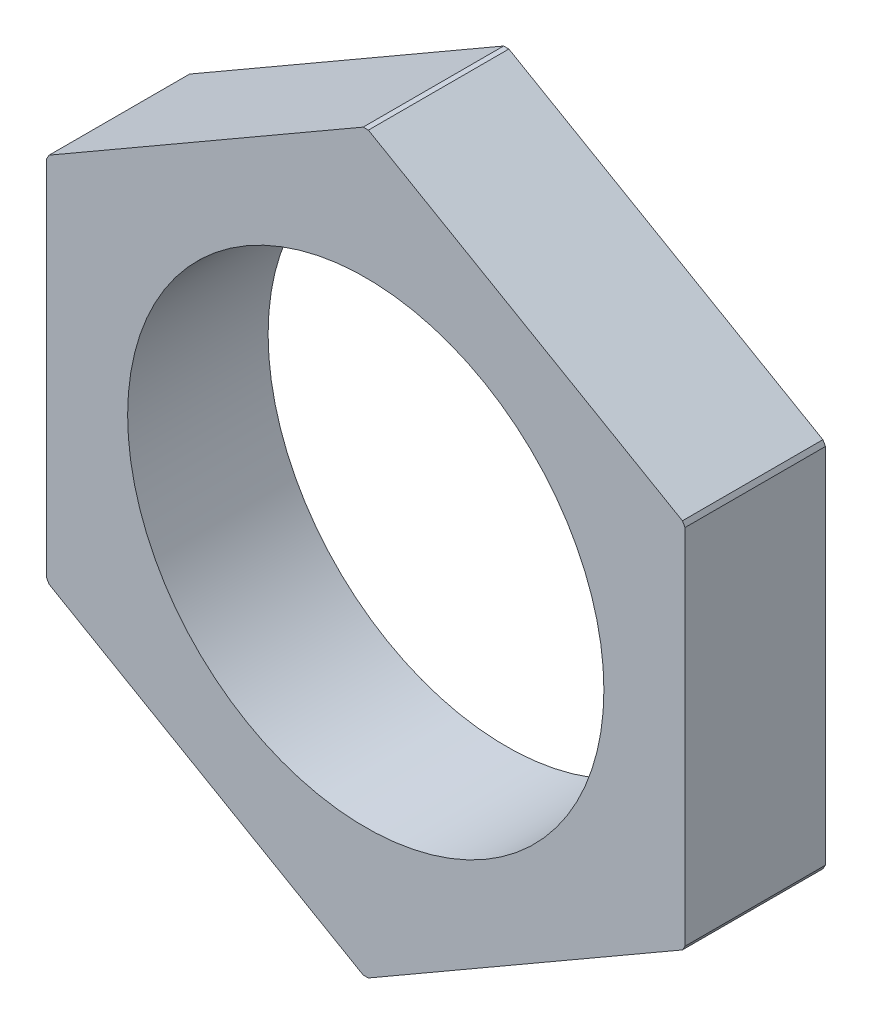
ISO-10303-21;
HEADER;
FILE_DESCRIPTION(('STEP AP214'),'2;1');
FILE_NAME('part.step','',(''),(''),'','','');
FILE_SCHEMA(('AUTOMOTIVE_DESIGN { 1 0 10303 214 1 1 1 1 }'));
ENDSEC;
DATA;
#1=APPLICATION_CONTEXT('core data for automotive mechanical design processes');
#2=APPLICATION_PROTOCOL_DEFINITION('international standard','automotive_design',2000,#1);
#3=PRODUCT_CONTEXT('',#1,'mechanical');
#4=PRODUCT('Part','Part','',(#3));
#5=PRODUCT_RELATED_PRODUCT_CATEGORY('part','',(#4));
#6=PRODUCT_DEFINITION_FORMATION('','',#4);
#7=PRODUCT_DEFINITION_CONTEXT('part definition',#1,'design');
#8=PRODUCT_DEFINITION('design','',#6,#7);
#9=PRODUCT_DEFINITION_SHAPE('','',#8);
#10=(LENGTH_UNIT() NAMED_UNIT(*) SI_UNIT(.MILLI.,.METRE.));
#11=(NAMED_UNIT(*) PLANE_ANGLE_UNIT() SI_UNIT($,.RADIAN.));
#12=(NAMED_UNIT(*) SI_UNIT($,.STERADIAN.) SOLID_ANGLE_UNIT());
#13=UNCERTAINTY_MEASURE_WITH_UNIT(LENGTH_MEASURE(1.E-05),#10,'distance_accuracy_value','');
#14=(GEOMETRIC_REPRESENTATION_CONTEXT(3) GLOBAL_UNCERTAINTY_ASSIGNED_CONTEXT((#13)) GLOBAL_UNIT_ASSIGNED_CONTEXT((#10,
#11,#12)) REPRESENTATION_CONTEXT('',''));
#15=CARTESIAN_POINT('',(0.,0.,0.));
#16=DIRECTION('',(0.,0.,1.));
#17=DIRECTION('',(1.,0.,0.));
#18=AXIS2_PLACEMENT_3D('',#15,#16,#17);
#19=CARTESIAN_POINT('',(-2.8,0.,5.));
#20=DIRECTION('',(0.,0.,-1.));
#21=DIRECTION('',(0.,1.,0.));
#22=AXIS2_PLACEMENT_3D('',#19,#20,#21);
#23=PLANE('',#22);
#24=CARTESIAN_POINT('',(-2.8,0.,5.));
#25=DIRECTION('',(0.,0.,1.));
#26=DIRECTION('',(1.,0.,0.));
#27=AXIS2_PLACEMENT_3D('',#24,#25,#26);
#28=CIRCLE('',#27,5.75);
#29=CARTESIAN_POINT('',(-7.75903944661326,2.91039993247213,5.));
#30=VERTEX_POINT('',#29);
#31=CARTESIAN_POINT('',(-7.8,2.83945417290015,5.));
#32=VERTEX_POINT('',#31);
#33=EDGE_CURVE('E195',#30,#32,#28,.T.);
#34=ORIENTED_EDGE('',*,*,#33,.F.);
#35=DIRECTION('',(-0.866025403784438,-0.5,0.));
#36=VECTOR('',#35,1.);
#37=CARTESIAN_POINT('',(-2.84096055338675,5.74985410537227,5.));
#38=LINE('',#37,#36);
#39=CARTESIAN_POINT('',(-2.84096055338675,5.74985410537227,5.));
#40=VERTEX_POINT('',#39);
#41=EDGE_CURVE('E40',#40,#30,#38,.T.);
#42=ORIENTED_EDGE('',*,*,#41,.F.);
#43=CARTESIAN_POINT('',(-2.8,0.,5.));
#44=DIRECTION('',(0.,0.,1.));
#45=DIRECTION('',(1.,0.,0.));
#46=AXIS2_PLACEMENT_3D('',#43,#44,#45);
#47=CIRCLE('',#46,5.75);
#48=CARTESIAN_POINT('',(-2.75903944661325,5.74985410537227,5.));
#49=VERTEX_POINT('',#48);
#50=EDGE_CURVE('E173',#49,#40,#47,.T.);
#51=ORIENTED_EDGE('',*,*,#50,.F.);
#52=DIRECTION('',(-0.866025403784438,0.5,0.));
#53=VECTOR('',#52,1.);
#54=CARTESIAN_POINT('',(2.15903944661326,2.91039993247213,5.));
#55=LINE('',#54,#53);
#56=CARTESIAN_POINT('',(2.15903944661326,2.91039993247213,5.));
#57=VERTEX_POINT('',#56);
#58=EDGE_CURVE('E176',#57,#49,#55,.T.);
#59=ORIENTED_EDGE('',*,*,#58,.F.);
#60=CARTESIAN_POINT('',(-2.8,0.,5.));
#61=DIRECTION('',(0.,0.,1.));
#62=DIRECTION('',(1.,0.,0.));
#63=AXIS2_PLACEMENT_3D('',#60,#61,#62);
#64=CIRCLE('',#63,5.75);
#65=CARTESIAN_POINT('',(2.2,2.83945417290015,5.));
#66=VERTEX_POINT('',#65);
#67=EDGE_CURVE('E207',#66,#57,#64,.T.);
#68=ORIENTED_EDGE('',*,*,#67,.F.);
#69=DIRECTION('',(0.,1.,0.));
#70=VECTOR('',#69,1.);
#71=CARTESIAN_POINT('',(2.2,-2.83945417290013,5.));
#72=LINE('',#71,#70);
#73=CARTESIAN_POINT('',(2.2,-2.83945417290013,5.));
#74=VERTEX_POINT('',#73);
#75=EDGE_CURVE('E117',#74,#66,#72,.T.);
#76=ORIENTED_EDGE('',*,*,#75,.F.);
#77=CARTESIAN_POINT('',(-2.8,0.,5.));
#78=DIRECTION('',(0.,0.,1.));
#79=DIRECTION('',(1.,0.,0.));
#80=AXIS2_PLACEMENT_3D('',#77,#78,#79);
#81=CIRCLE('',#80,5.75);
#82=CARTESIAN_POINT('',(2.15903944661326,-2.91039993247211,5.));
#83=VERTEX_POINT('',#82);
#84=EDGE_CURVE('E230',#83,#74,#81,.T.);
#85=ORIENTED_EDGE('',*,*,#84,.F.);
#86=DIRECTION('',(0.866025403784439,0.5,0.));
#87=VECTOR('',#86,1.);
#88=CARTESIAN_POINT('',(-2.75903944661325,-5.74985410537225,5.));
#89=LINE('',#88,#87);
#90=CARTESIAN_POINT('',(-2.75903944661325,-5.74985410537225,5.));
#91=VERTEX_POINT('',#90);
#92=EDGE_CURVE('E231',#91,#83,#89,.T.);
#93=ORIENTED_EDGE('',*,*,#92,.F.);
#94=CARTESIAN_POINT('',(-2.8,0.,5.));
#95=DIRECTION('',(0.,0.,1.));
#96=DIRECTION('',(1.,0.,0.));
#97=AXIS2_PLACEMENT_3D('',#94,#95,#96);
#98=CIRCLE('',#97,5.75);
#99=CARTESIAN_POINT('',(-2.84096055338675,-5.74985410537225,5.));
#100=VERTEX_POINT('',#99);
#101=EDGE_CURVE('E249',#100,#91,#98,.T.);
#102=ORIENTED_EDGE('',*,*,#101,.F.);
#103=DIRECTION('',(0.866025403784439,-0.5,0.));
#104=VECTOR('',#103,1.);
#105=CARTESIAN_POINT('',(-7.75903944661326,-2.91039993247211,5.));
#106=LINE('',#105,#104);
#107=CARTESIAN_POINT('',(-7.75903944661326,-2.91039993247211,5.));
#108=VERTEX_POINT('',#107);
#109=EDGE_CURVE('E243',#108,#100,#106,.T.);
#110=ORIENTED_EDGE('',*,*,#109,.F.);
#111=CARTESIAN_POINT('',(-2.8,0.,5.));
#112=DIRECTION('',(0.,0.,1.));
#113=DIRECTION('',(1.,0.,0.));
#114=AXIS2_PLACEMENT_3D('',#111,#112,#113);
#115=CIRCLE('',#114,5.75);
#116=CARTESIAN_POINT('',(-7.8,-2.83945417290013,5.));
#117=VERTEX_POINT('',#116);
#118=EDGE_CURVE('E217',#117,#108,#115,.T.);
#119=ORIENTED_EDGE('',*,*,#118,.F.);
#120=DIRECTION('',(0.,-1.,0.));
#121=VECTOR('',#120,1.);
#122=CARTESIAN_POINT('',(-7.8,2.83945417290015,5.));
#123=LINE('',#122,#121);
#124=EDGE_CURVE('E212',#32,#117,#123,.T.);
#125=ORIENTED_EDGE('',*,*,#124,.F.);
#126=EDGE_LOOP('',(#34,#42,#51,#59,#68,#76,#85,#93,#102,#110,#119,#125));
#127=FACE_BOUND('',#126,.T.);
#128=CARTESIAN_POINT('',(-2.8,0.,5.));
#129=DIRECTION('',(0.,0.,1.));
#130=DIRECTION('',(1.,0.,0.));
#131=AXIS2_PLACEMENT_3D('',#128,#129,#130);
#132=CIRCLE('',#131,3.7295);
#133=CARTESIAN_POINT('',(0.9295,0.,5.));
#134=VERTEX_POINT('',#133);
#135=EDGE_CURVE('E10',#134,#134,#132,.T.);
#136=ORIENTED_EDGE('',*,*,#135,.T.);
#137=EDGE_LOOP('',(#136));
#138=FACE_BOUND('',#137,.T.);
#139=ADVANCED_FACE('F15',(#127,#138),#23,.T.);
#140=CARTESIAN_POINT('',(-2.8,0.,7.2));
#141=DIRECTION('',(0.,0.,1.));
#142=DIRECTION('',(1.,0.,0.));
#143=AXIS2_PLACEMENT_3D('',#140,#141,#142);
#144=PLANE('',#143);
#145=CARTESIAN_POINT('',(-2.8,0.,7.2));
#146=DIRECTION('',(0.,0.,-1.));
#147=DIRECTION('',(-1.,0.,0.));
#148=AXIS2_PLACEMENT_3D('',#145,#146,#147);
#149=CIRCLE('',#148,5.75);
#150=CARTESIAN_POINT('',(-2.84096055338675,5.74985410537227,7.2));
#151=VERTEX_POINT('',#150);
#152=CARTESIAN_POINT('',(-2.75903944661326,5.74985410537227,7.2));
#153=VERTEX_POINT('',#152);
#154=EDGE_CURVE('E149',#151,#153,#149,.T.);
#155=ORIENTED_EDGE('',*,*,#154,.F.);
#156=DIRECTION('',(-0.866025403784438,-0.5,0.));
#157=VECTOR('',#156,1.);
#158=CARTESIAN_POINT('',(-2.84096055338675,5.74985410537227,7.2));
#159=LINE('',#158,#157);
#160=CARTESIAN_POINT('',(-7.75903944661326,2.91039993247213,7.2));
#161=VERTEX_POINT('',#160);
#162=EDGE_CURVE('E26',#151,#161,#159,.T.);
#163=ORIENTED_EDGE('',*,*,#162,.T.);
#164=CARTESIAN_POINT('',(-2.8,0.,7.2));
#165=DIRECTION('',(0.,0.,-1.));
#166=DIRECTION('',(-1.,0.,0.));
#167=AXIS2_PLACEMENT_3D('',#164,#165,#166);
#168=CIRCLE('',#167,5.75);
#169=CARTESIAN_POINT('',(-7.8,2.83945417290016,7.2));
#170=VERTEX_POINT('',#169);
#171=EDGE_CURVE('E160',#170,#161,#168,.T.);
#172=ORIENTED_EDGE('',*,*,#171,.F.);
#173=DIRECTION('',(0.,-1.,0.));
#174=VECTOR('',#173,1.);
#175=CARTESIAN_POINT('',(-7.8,2.83945417290016,7.2));
#176=LINE('',#175,#174);
#177=CARTESIAN_POINT('',(-7.8,-2.83945417290014,7.2));
#178=VERTEX_POINT('',#177);
#179=EDGE_CURVE('E200',#170,#178,#176,.T.);
#180=ORIENTED_EDGE('',*,*,#179,.T.);
#181=CARTESIAN_POINT('',(-2.8,0.,7.2));
#182=DIRECTION('',(0.,0.,-1.));
#183=DIRECTION('',(-1.,0.,0.));
#184=AXIS2_PLACEMENT_3D('',#181,#182,#183);
#185=CIRCLE('',#184,5.75);
#186=CARTESIAN_POINT('',(-7.75903944661326,-2.91039993247211,7.2));
#187=VERTEX_POINT('',#186);
#188=EDGE_CURVE('E196',#187,#178,#185,.T.);
#189=ORIENTED_EDGE('',*,*,#188,.F.);
#190=DIRECTION('',(0.866025403784439,-0.5,0.));
#191=VECTOR('',#190,1.);
#192=CARTESIAN_POINT('',(-7.75903944661326,-2.91039993247211,7.2));
#193=LINE('',#192,#191);
#194=CARTESIAN_POINT('',(-2.84096055338674,-5.74985410537225,7.2));
#195=VERTEX_POINT('',#194);
#196=EDGE_CURVE('E204',#187,#195,#193,.T.);
#197=ORIENTED_EDGE('',*,*,#196,.T.);
#198=CARTESIAN_POINT('',(-2.8,0.,7.2));
#199=DIRECTION('',(0.,0.,-1.));
#200=DIRECTION('',(-1.,0.,0.));
#201=AXIS2_PLACEMENT_3D('',#198,#199,#200);
#202=CIRCLE('',#201,5.75);
#203=CARTESIAN_POINT('',(-2.75903944661325,-5.74985410537225,7.2));
#204=VERTEX_POINT('',#203);
#205=EDGE_CURVE('E246',#204,#195,#202,.T.);
#206=ORIENTED_EDGE('',*,*,#205,.F.);
#207=DIRECTION('',(0.866025403784439,0.5,0.));
#208=VECTOR('',#207,1.);
#209=CARTESIAN_POINT('',(-2.75903944661325,-5.74985410537225,7.2));
#210=LINE('',#209,#208);
#211=CARTESIAN_POINT('',(2.15903944661326,-2.9103999324721,7.2));
#212=VERTEX_POINT('',#211);
#213=EDGE_CURVE('E208',#204,#212,#210,.T.);
#214=ORIENTED_EDGE('',*,*,#213,.T.);
#215=CARTESIAN_POINT('',(-2.8,0.,7.2));
#216=DIRECTION('',(0.,0.,-1.));
#217=DIRECTION('',(-1.,0.,0.));
#218=AXIS2_PLACEMENT_3D('',#215,#216,#217);
#219=CIRCLE('',#218,5.75);
#220=CARTESIAN_POINT('',(2.2,-2.83945417290013,7.2));
#221=VERTEX_POINT('',#220);
#222=EDGE_CURVE('E227',#221,#212,#219,.T.);
#223=ORIENTED_EDGE('',*,*,#222,.F.);
#224=DIRECTION('',(0.,1.,0.));
#225=VECTOR('',#224,1.);
#226=CARTESIAN_POINT('',(2.2,-2.83945417290013,7.2));
#227=LINE('',#226,#225);
#228=CARTESIAN_POINT('',(2.2,2.83945417290016,7.2));
#229=VERTEX_POINT('',#228);
#230=EDGE_CURVE('E172',#221,#229,#227,.T.);
#231=ORIENTED_EDGE('',*,*,#230,.T.);
#232=CARTESIAN_POINT('',(-2.8,0.,7.2));
#233=DIRECTION('',(0.,0.,-1.));
#234=DIRECTION('',(-1.,0.,0.));
#235=AXIS2_PLACEMENT_3D('',#232,#233,#234);
#236=CIRCLE('',#235,5.75);
#237=CARTESIAN_POINT('',(2.15903944661326,2.91039993247214,7.2));
#238=VERTEX_POINT('',#237);
#239=EDGE_CURVE('E167',#238,#229,#236,.T.);
#240=ORIENTED_EDGE('',*,*,#239,.F.);
#241=DIRECTION('',(-0.866025403784438,0.5,0.));
#242=VECTOR('',#241,1.);
#243=CARTESIAN_POINT('',(2.15903944661326,2.91039993247214,7.2));
#244=LINE('',#243,#242);
#245=EDGE_CURVE('E163',#238,#153,#244,.T.);
#246=ORIENTED_EDGE('',*,*,#245,.T.);
#247=EDGE_LOOP('',(#155,#163,#172,#180,#189,#197,#206,#214,#223,#231,#240,#246));
#248=FACE_BOUND('',#247,.T.);
#249=CARTESIAN_POINT('',(-2.8,0.,7.2));
#250=DIRECTION('',(0.,0.,1.));
#251=DIRECTION('',(1.,0.,0.));
#252=AXIS2_PLACEMENT_3D('',#249,#250,#251);
#253=CIRCLE('',#252,3.7295);
#254=CARTESIAN_POINT('',(0.9295,0.,7.2));
#255=VERTEX_POINT('',#254);
#256=EDGE_CURVE('E250',#255,#255,#253,.T.);
#257=ORIENTED_EDGE('',*,*,#256,.F.);
#258=EDGE_LOOP('',(#257));
#259=FACE_BOUND('',#258,.T.);
#260=ADVANCED_FACE('F164',(#248,#259),#144,.T.);
#261=CARTESIAN_POINT('',(-2.8,0.,7.2));
#262=DIRECTION('',(0.,0.,-1.));
#263=DIRECTION('',(-1.,0.,0.));
#264=AXIS2_PLACEMENT_3D('',#261,#262,#263);
#265=CYLINDRICAL_SURFACE('',#264,5.75);
#266=ORIENTED_EDGE('',*,*,#50,.T.);
#267=DIRECTION('',(0.,0.,1.));
#268=VECTOR('',#267,1.);
#269=CARTESIAN_POINT('',(-2.84096055338675,5.74985410537227,5.));
#270=LINE('',#269,#268);
#271=EDGE_CURVE('E155',#40,#151,#270,.T.);
#272=ORIENTED_EDGE('',*,*,#271,.T.);
#273=ORIENTED_EDGE('',*,*,#154,.T.);
#274=DIRECTION('',(0.,0.,1.));
#275=VECTOR('',#274,1.);
#276=CARTESIAN_POINT('',(-2.75903944661326,5.74985410537227,5.));
#277=LINE('',#276,#275);
#278=EDGE_CURVE('E154',#49,#153,#277,.T.);
#279=ORIENTED_EDGE('',*,*,#278,.F.);
#280=EDGE_LOOP('',(#266,#272,#273,#279));
#281=FACE_BOUND('',#280,.T.);
#282=ADVANCED_FACE('F152',(#281),#265,.T.);
#283=CARTESIAN_POINT('',(-2.8,0.,7.2));
#284=DIRECTION('',(0.,0.,-1.));
#285=DIRECTION('',(-1.,0.,0.));
#286=AXIS2_PLACEMENT_3D('',#283,#284,#285);
#287=CYLINDRICAL_SURFACE('',#286,5.75);
#288=ORIENTED_EDGE('',*,*,#171,.T.);
#289=DIRECTION('',(0.,0.,1.));
#290=VECTOR('',#289,1.);
#291=CARTESIAN_POINT('',(-7.75903944661326,2.91039993247213,5.));
#292=LINE('',#291,#290);
#293=EDGE_CURVE('E237',#30,#161,#292,.T.);
#294=ORIENTED_EDGE('',*,*,#293,.F.);
#295=ORIENTED_EDGE('',*,*,#33,.T.);
#296=DIRECTION('',(0.,0.,1.));
#297=VECTOR('',#296,1.);
#298=CARTESIAN_POINT('',(-7.8,2.83945417290015,5.));
#299=LINE('',#298,#297);
#300=EDGE_CURVE('E192',#32,#170,#299,.T.);
#301=ORIENTED_EDGE('',*,*,#300,.T.);
#302=EDGE_LOOP('',(#288,#294,#295,#301));
#303=FACE_BOUND('',#302,.T.);
#304=ADVANCED_FACE('F259',(#303),#287,.T.);
#305=CARTESIAN_POINT('',(-2.8,0.,7.2));
#306=DIRECTION('',(0.,0.,-1.));
#307=DIRECTION('',(-1.,0.,0.));
#308=AXIS2_PLACEMENT_3D('',#305,#306,#307);
#309=CYLINDRICAL_SURFACE('',#308,5.75);
#310=ORIENTED_EDGE('',*,*,#188,.T.);
#311=DIRECTION('',(0.,0.,1.));
#312=VECTOR('',#311,1.);
#313=CARTESIAN_POINT('',(-7.8,-2.83945417290014,5.));
#314=LINE('',#313,#312);
#315=EDGE_CURVE('E216',#117,#178,#314,.T.);
#316=ORIENTED_EDGE('',*,*,#315,.F.);
#317=ORIENTED_EDGE('',*,*,#118,.T.);
#318=DIRECTION('',(0.,0.,1.));
#319=VECTOR('',#318,1.);
#320=CARTESIAN_POINT('',(-7.75903944661326,-2.91039993247211,5.));
#321=LINE('',#320,#319);
#322=EDGE_CURVE('E220',#108,#187,#321,.T.);
#323=ORIENTED_EDGE('',*,*,#322,.T.);
#324=EDGE_LOOP('',(#310,#316,#317,#323));
#325=FACE_BOUND('',#324,.T.);
#326=ADVANCED_FACE('F319',(#325),#309,.T.);
#327=CARTESIAN_POINT('',(-2.8,0.,7.2));
#328=DIRECTION('',(0.,0.,-1.));
#329=DIRECTION('',(-1.,0.,0.));
#330=AXIS2_PLACEMENT_3D('',#327,#328,#329);
#331=CYLINDRICAL_SURFACE('',#330,5.75);
#332=ORIENTED_EDGE('',*,*,#205,.T.);
#333=DIRECTION('',(0.,0.,1.));
#334=VECTOR('',#333,1.);
#335=CARTESIAN_POINT('',(-2.84096055338674,-5.74985410537225,5.));
#336=LINE('',#335,#334);
#337=EDGE_CURVE('E215',#100,#195,#336,.T.);
#338=ORIENTED_EDGE('',*,*,#337,.F.);
#339=ORIENTED_EDGE('',*,*,#101,.T.);
#340=DIRECTION('',(0.,0.,1.));
#341=VECTOR('',#340,1.);
#342=CARTESIAN_POINT('',(-2.75903944661325,-5.74985410537225,5.));
#343=LINE('',#342,#341);
#344=EDGE_CURVE('E19',#91,#204,#343,.T.);
#345=ORIENTED_EDGE('',*,*,#344,.T.);
#346=EDGE_LOOP('',(#332,#338,#339,#345));
#347=FACE_BOUND('',#346,.T.);
#348=ADVANCED_FACE('F321',(#347),#331,.T.);
#349=CARTESIAN_POINT('',(-2.8,0.,7.2));
#350=DIRECTION('',(0.,0.,-1.));
#351=DIRECTION('',(-1.,0.,0.));
#352=AXIS2_PLACEMENT_3D('',#349,#350,#351);
#353=CYLINDRICAL_SURFACE('',#352,5.75);
#354=ORIENTED_EDGE('',*,*,#222,.T.);
#355=DIRECTION('',(0.,0.,1.));
#356=VECTOR('',#355,1.);
#357=CARTESIAN_POINT('',(2.15903944661326,-2.91039993247211,5.));
#358=LINE('',#357,#356);
#359=EDGE_CURVE('E234',#83,#212,#358,.T.);
#360=ORIENTED_EDGE('',*,*,#359,.F.);
#361=ORIENTED_EDGE('',*,*,#84,.T.);
#362=DIRECTION('',(0.,0.,1.));
#363=VECTOR('',#362,1.);
#364=CARTESIAN_POINT('',(2.2,-2.83945417290013,5.));
#365=LINE('',#364,#363);
#366=EDGE_CURVE('E273',#74,#221,#365,.T.);
#367=ORIENTED_EDGE('',*,*,#366,.T.);
#368=EDGE_LOOP('',(#354,#360,#361,#367));
#369=FACE_BOUND('',#368,.T.);
#370=ADVANCED_FACE('F286',(#369),#353,.T.);
#371=CARTESIAN_POINT('',(-2.8,0.,7.2));
#372=DIRECTION('',(0.,0.,-1.));
#373=DIRECTION('',(-1.,0.,0.));
#374=AXIS2_PLACEMENT_3D('',#371,#372,#373);
#375=CYLINDRICAL_SURFACE('',#374,5.75);
#376=ORIENTED_EDGE('',*,*,#239,.T.);
#377=DIRECTION('',(0.,0.,1.));
#378=VECTOR('',#377,1.);
#379=CARTESIAN_POINT('',(2.2,2.83945417290015,5.));
#380=LINE('',#379,#378);
#381=EDGE_CURVE('E187',#66,#229,#380,.T.);
#382=ORIENTED_EDGE('',*,*,#381,.F.);
#383=ORIENTED_EDGE('',*,*,#67,.T.);
#384=DIRECTION('',(0.,0.,1.));
#385=VECTOR('',#384,1.);
#386=CARTESIAN_POINT('',(2.15903944661326,2.91039993247213,5.));
#387=LINE('',#386,#385);
#388=EDGE_CURVE('E184',#57,#238,#387,.T.);
#389=ORIENTED_EDGE('',*,*,#388,.T.);
#390=EDGE_LOOP('',(#376,#382,#383,#389));
#391=FACE_BOUND('',#390,.T.);
#392=ADVANCED_FACE('F281',(#391),#375,.T.);
#393=CARTESIAN_POINT('',(2.15903944661326,2.91039993247213,5.));
#394=DIRECTION('',(0.5,0.866025403784438,0.));
#395=DIRECTION('',(0.,0.,-1.));
#396=AXIS2_PLACEMENT_3D('',#393,#394,#395);
#397=PLANE('',#396);
#398=ORIENTED_EDGE('',*,*,#245,.F.);
#399=ORIENTED_EDGE('',*,*,#388,.F.);
#400=ORIENTED_EDGE('',*,*,#58,.T.);
#401=ORIENTED_EDGE('',*,*,#278,.T.);
#402=EDGE_LOOP('',(#398,#399,#400,#401));
#403=FACE_BOUND('',#402,.T.);
#404=ADVANCED_FACE('F175',(#403),#397,.T.);
#405=CARTESIAN_POINT('',(2.2,-2.83945417290013,5.));
#406=DIRECTION('',(1.,0.,0.));
#407=DIRECTION('',(0.,0.,-1.));
#408=AXIS2_PLACEMENT_3D('',#405,#406,#407);
#409=PLANE('',#408);
#410=ORIENTED_EDGE('',*,*,#230,.F.);
#411=ORIENTED_EDGE('',*,*,#366,.F.);
#412=ORIENTED_EDGE('',*,*,#75,.T.);
#413=ORIENTED_EDGE('',*,*,#381,.T.);
#414=EDGE_LOOP('',(#410,#411,#412,#413));
#415=FACE_BOUND('',#414,.T.);
#416=ADVANCED_FACE('F278',(#415),#409,.T.);
#417=CARTESIAN_POINT('',(-2.75903944661325,-5.74985410537225,5.));
#418=DIRECTION('',(0.5,-0.866025403784439,0.));
#419=DIRECTION('',(0.,0.,1.));
#420=AXIS2_PLACEMENT_3D('',#417,#418,#419);
#421=PLANE('',#420);
#422=ORIENTED_EDGE('',*,*,#213,.F.);
#423=ORIENTED_EDGE('',*,*,#344,.F.);
#424=ORIENTED_EDGE('',*,*,#92,.T.);
#425=ORIENTED_EDGE('',*,*,#359,.T.);
#426=EDGE_LOOP('',(#422,#423,#424,#425));
#427=FACE_BOUND('',#426,.T.);
#428=ADVANCED_FACE('F345',(#427),#421,.T.);
#429=CARTESIAN_POINT('',(-7.75903944661326,-2.91039993247211,5.));
#430=DIRECTION('',(-0.5,-0.866025403784439,0.));
#431=DIRECTION('',(-0.866025403784439,0.5,0.));
#432=AXIS2_PLACEMENT_3D('',#429,#430,#431);
#433=PLANE('',#432);
#434=ORIENTED_EDGE('',*,*,#196,.F.);
#435=ORIENTED_EDGE('',*,*,#322,.F.);
#436=ORIENTED_EDGE('',*,*,#109,.T.);
#437=ORIENTED_EDGE('',*,*,#337,.T.);
#438=EDGE_LOOP('',(#434,#435,#436,#437));
#439=FACE_BOUND('',#438,.T.);
#440=ADVANCED_FACE('F17',(#439),#433,.T.);
#441=CARTESIAN_POINT('',(-7.8,2.83945417290015,5.));
#442=DIRECTION('',(-1.,0.,0.));
#443=DIRECTION('',(0.,-1.,0.));
#444=AXIS2_PLACEMENT_3D('',#441,#442,#443);
#445=PLANE('',#444);
#446=ORIENTED_EDGE('',*,*,#179,.F.);
#447=ORIENTED_EDGE('',*,*,#300,.F.);
#448=ORIENTED_EDGE('',*,*,#124,.T.);
#449=ORIENTED_EDGE('',*,*,#315,.T.);
#450=EDGE_LOOP('',(#446,#447,#448,#449));
#451=FACE_BOUND('',#450,.T.);
#452=ADVANCED_FACE('F313',(#451),#445,.T.);
#453=CARTESIAN_POINT('',(-2.84096055338675,5.74985410537227,5.));
#454=DIRECTION('',(-0.5,0.866025403784438,0.));
#455=DIRECTION('',(0.,0.,1.));
#456=AXIS2_PLACEMENT_3D('',#453,#454,#455);
#457=PLANE('',#456);
#458=ORIENTED_EDGE('',*,*,#162,.F.);
#459=ORIENTED_EDGE('',*,*,#271,.F.);
#460=ORIENTED_EDGE('',*,*,#41,.T.);
#461=ORIENTED_EDGE('',*,*,#293,.T.);
#462=EDGE_LOOP('',(#458,#459,#460,#461));
#463=FACE_BOUND('',#462,.T.);
#464=ADVANCED_FACE('F257',(#463),#457,.T.);
#465=CARTESIAN_POINT('',(-2.8,0.,5.));
#466=DIRECTION('',(0.,0.,1.));
#467=DIRECTION('',(1.,0.,0.));
#468=AXIS2_PLACEMENT_3D('',#465,#466,#467);
#469=CYLINDRICAL_SURFACE('',#468,3.7295);
#470=ORIENTED_EDGE('',*,*,#256,.T.);
#471=EDGE_LOOP('',(#470));
#472=FACE_BOUND('',#471,.T.);
#473=ORIENTED_EDGE('',*,*,#135,.F.);
#474=EDGE_LOOP('',(#473));
#475=FACE_BOUND('',#474,.T.);
#476=ADVANCED_FACE('F372',(#472,#475),#469,.F.);
#477=CLOSED_SHELL('',(#139,#260,#282,#304,#326,#348,#370,#392,#404,#416,#428,#440,#452,#464,#476));
#478=MANIFOLD_SOLID_BREP('B1',#477);
#479=ADVANCED_BREP_SHAPE_REPRESENTATION('',(#18,#478),#14);
#480=SHAPE_DEFINITION_REPRESENTATION(#9,#479);
ENDSEC;
END-ISO-10303-21;
